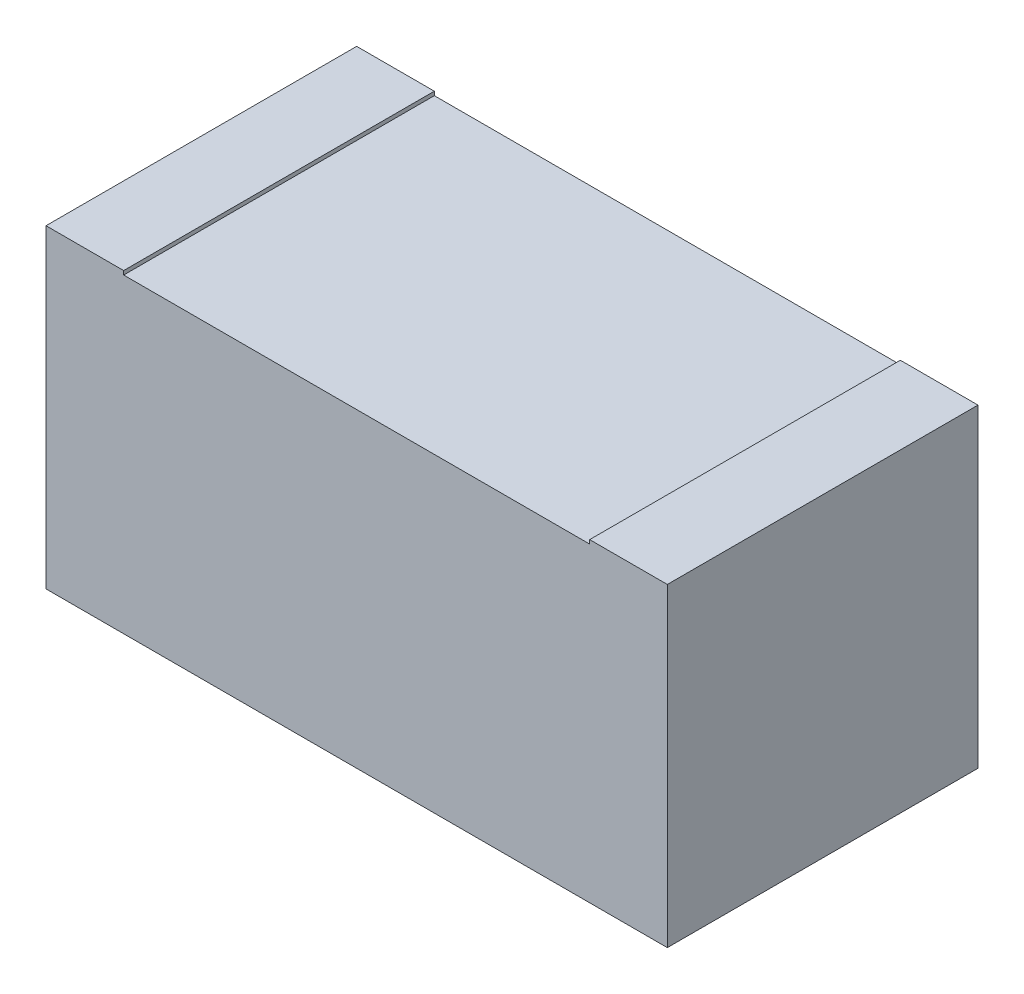
ISO-10303-21;
HEADER;
FILE_DESCRIPTION(('STEP AP214'),'2;1');
FILE_NAME('part.step','',(''),(''),'','','');
FILE_SCHEMA(('AUTOMOTIVE_DESIGN { 1 0 10303 214 1 1 1 1 }'));
ENDSEC;
DATA;
#1=APPLICATION_CONTEXT('core data for automotive mechanical design processes');
#2=APPLICATION_PROTOCOL_DEFINITION('international standard','automotive_design',2000,#1);
#3=PRODUCT_CONTEXT('',#1,'mechanical');
#4=PRODUCT('Part','Part','',(#3));
#5=PRODUCT_RELATED_PRODUCT_CATEGORY('part','',(#4));
#6=PRODUCT_DEFINITION_FORMATION('','',#4);
#7=PRODUCT_DEFINITION_CONTEXT('part definition',#1,'design');
#8=PRODUCT_DEFINITION('design','',#6,#7);
#9=PRODUCT_DEFINITION_SHAPE('','',#8);
#10=(LENGTH_UNIT() NAMED_UNIT(*) SI_UNIT(.MILLI.,.METRE.));
#11=(NAMED_UNIT(*) PLANE_ANGLE_UNIT() SI_UNIT($,.RADIAN.));
#12=(NAMED_UNIT(*) SI_UNIT($,.STERADIAN.) SOLID_ANGLE_UNIT());
#13=UNCERTAINTY_MEASURE_WITH_UNIT(LENGTH_MEASURE(1.E-05),#10,'distance_accuracy_value','');
#14=(GEOMETRIC_REPRESENTATION_CONTEXT(3) GLOBAL_UNCERTAINTY_ASSIGNED_CONTEXT((#13)) GLOBAL_UNIT_ASSIGNED_CONTEXT((#10,
#11,#12)) REPRESENTATION_CONTEXT('',''));
#15=CARTESIAN_POINT('',(0.,0.,0.));
#16=DIRECTION('',(0.,0.,1.));
#17=DIRECTION('',(1.,0.,0.));
#18=AXIS2_PLACEMENT_3D('',#15,#16,#17);
#19=CARTESIAN_POINT('',(0.,0.8,0.));
#20=DIRECTION('',(0.,1.,0.));
#21=DIRECTION('',(0.,0.,1.));
#22=AXIS2_PLACEMENT_3D('',#19,#20,#21);
#23=PLANE('',#22);
#24=DIRECTION('',(1.,0.,0.));
#25=VECTOR('',#24,1.);
#26=CARTESIAN_POINT('',(-0.853781512605042,0.8,0.430252100840336));
#27=LINE('',#26,#25);
#28=CARTESIAN_POINT('',(-0.653781512605042,0.8,0.430252100840336));
#29=VERTEX_POINT('',#28);
#30=CARTESIAN_POINT('',(0.546218487394958,0.8,0.430252100840336));
#31=VERTEX_POINT('',#30);
#32=EDGE_CURVE('E57',#29,#31,#27,.T.);
#33=ORIENTED_EDGE('',*,*,#32,.T.);
#34=DIRECTION('',(0.,0.,1.));
#35=VECTOR('',#34,1.);
#36=CARTESIAN_POINT('',(0.546218487394958,0.8,-0.369747899159664));
#37=LINE('',#36,#35);
#38=CARTESIAN_POINT('',(0.546218487394958,0.8,-0.369747899159664));
#39=VERTEX_POINT('',#38);
#40=EDGE_CURVE('E52',#39,#31,#37,.T.);
#41=ORIENTED_EDGE('',*,*,#40,.F.);
#42=DIRECTION('',(-1.,0.,0.));
#43=VECTOR('',#42,1.);
#44=CARTESIAN_POINT('',(-0.853781512605042,0.8,-0.369747899159664));
#45=LINE('',#44,#43);
#46=CARTESIAN_POINT('',(-0.653781512605042,0.8,-0.369747899159664));
#47=VERTEX_POINT('',#46);
#48=EDGE_CURVE('E155',#39,#47,#45,.T.);
#49=ORIENTED_EDGE('',*,*,#48,.T.);
#50=DIRECTION('',(0.,0.,-1.));
#51=VECTOR('',#50,1.);
#52=CARTESIAN_POINT('',(-0.653781512605042,0.8,-0.369747899159664));
#53=LINE('',#52,#51);
#54=EDGE_CURVE('E134',#29,#47,#53,.T.);
#55=ORIENTED_EDGE('',*,*,#54,.F.);
#56=EDGE_LOOP('',(#33,#41,#49,#55));
#57=FACE_BOUND('',#56,.T.);
#58=ADVANCED_FACE('F37',(#57),#23,.T.);
#59=CARTESIAN_POINT('',(-0.853781512605042,0.8,-0.369747899159664));
#60=DIRECTION('',(1.,0.,0.));
#61=DIRECTION('',(0.,0.,-1.));
#62=AXIS2_PLACEMENT_3D('',#59,#60,#61);
#63=PLANE('',#62);
#64=DIRECTION('',(0.,0.,1.));
#65=VECTOR('',#64,1.);
#66=CARTESIAN_POINT('',(-0.853781512605042,0.,-0.369747899159664));
#67=LINE('',#66,#65);
#68=CARTESIAN_POINT('',(-0.853781512605042,0.,-0.369747899159664));
#69=VERTEX_POINT('',#68);
#70=CARTESIAN_POINT('',(-0.853781512605042,0.,0.430252100840336));
#71=VERTEX_POINT('',#70);
#72=EDGE_CURVE('E153',#69,#71,#67,.T.);
#73=ORIENTED_EDGE('',*,*,#72,.T.);
#74=DIRECTION('',(0.,-1.,0.));
#75=VECTOR('',#74,1.);
#76=CARTESIAN_POINT('',(-0.853781512605042,0.8,0.430252100840336));
#77=LINE('',#76,#75);
#78=CARTESIAN_POINT('',(-0.853781512605042,0.81,0.430252100840336));
#79=VERTEX_POINT('',#78);
#80=EDGE_CURVE('E11',#79,#71,#77,.T.);
#81=ORIENTED_EDGE('',*,*,#80,.F.);
#82=DIRECTION('',(0.,0.,1.));
#83=VECTOR('',#82,1.);
#84=CARTESIAN_POINT('',(-0.853781512605042,0.81,-0.369747899159664));
#85=LINE('',#84,#83);
#86=CARTESIAN_POINT('',(-0.853781512605042,0.81,-0.369747899159664));
#87=VERTEX_POINT('',#86);
#88=EDGE_CURVE('E135',#87,#79,#85,.T.);
#89=ORIENTED_EDGE('',*,*,#88,.F.);
#90=DIRECTION('',(0.,-1.,0.));
#91=VECTOR('',#90,1.);
#92=CARTESIAN_POINT('',(-0.853781512605042,0.8,-0.369747899159664));
#93=LINE('',#92,#91);
#94=EDGE_CURVE('E110',#87,#69,#93,.T.);
#95=ORIENTED_EDGE('',*,*,#94,.T.);
#96=EDGE_LOOP('',(#73,#81,#89,#95));
#97=FACE_BOUND('',#96,.T.);
#98=ADVANCED_FACE('F39',(#97),#63,.F.);
#99=CARTESIAN_POINT('',(-0.853781512605042,0.8,0.430252100840336));
#100=DIRECTION('',(0.,0.,-1.));
#101=DIRECTION('',(-1.,0.,0.));
#102=AXIS2_PLACEMENT_3D('',#99,#100,#101);
#103=PLANE('',#102);
#104=DIRECTION('',(1.,0.,0.));
#105=VECTOR('',#104,1.);
#106=CARTESIAN_POINT('',(-0.853781512605042,0.,0.430252100840336));
#107=LINE('',#106,#105);
#108=CARTESIAN_POINT('',(0.746218487394958,0.,0.430252100840336));
#109=VERTEX_POINT('',#108);
#110=EDGE_CURVE('E160',#71,#109,#107,.T.);
#111=ORIENTED_EDGE('',*,*,#110,.T.);
#112=DIRECTION('',(0.,-1.,0.));
#113=VECTOR('',#112,1.);
#114=CARTESIAN_POINT('',(0.746218487394958,0.8,0.430252100840336));
#115=LINE('',#114,#113);
#116=CARTESIAN_POINT('',(0.746218487394958,0.81,0.430252100840336));
#117=VERTEX_POINT('',#116);
#118=EDGE_CURVE('E45',#117,#109,#115,.T.);
#119=ORIENTED_EDGE('',*,*,#118,.F.);
#120=DIRECTION('',(1.,0.,0.));
#121=VECTOR('',#120,1.);
#122=CARTESIAN_POINT('',(0.746218487394958,0.81,0.430252100840336));
#123=LINE('',#122,#121);
#124=CARTESIAN_POINT('',(0.546218487394958,0.81,0.430252100840336));
#125=VERTEX_POINT('',#124);
#126=EDGE_CURVE('E124',#125,#117,#123,.T.);
#127=ORIENTED_EDGE('',*,*,#126,.F.);
#128=DIRECTION('',(0.,-1.,0.));
#129=VECTOR('',#128,1.);
#130=CARTESIAN_POINT('',(0.546218487394958,0.81,0.430252100840336));
#131=LINE('',#130,#129);
#132=EDGE_CURVE('E129',#125,#31,#131,.T.);
#133=ORIENTED_EDGE('',*,*,#132,.T.);
#134=ORIENTED_EDGE('',*,*,#32,.F.);
#135=DIRECTION('',(0.,-1.,0.));
#136=VECTOR('',#135,1.);
#137=CARTESIAN_POINT('',(-0.653781512605042,0.81,0.430252100840336));
#138=LINE('',#137,#136);
#139=CARTESIAN_POINT('',(-0.653781512605042,0.81,0.430252100840336));
#140=VERTEX_POINT('',#139);
#141=EDGE_CURVE('E150',#140,#29,#138,.T.);
#142=ORIENTED_EDGE('',*,*,#141,.F.);
#143=DIRECTION('',(1.,0.,0.));
#144=VECTOR('',#143,1.);
#145=CARTESIAN_POINT('',(-0.853781512605042,0.81,0.430252100840336));
#146=LINE('',#145,#144);
#147=EDGE_CURVE('E138',#79,#140,#146,.T.);
#148=ORIENTED_EDGE('',*,*,#147,.F.);
#149=ORIENTED_EDGE('',*,*,#80,.T.);
#150=EDGE_LOOP('',(#111,#119,#127,#133,#134,#142,#148,#149));
#151=FACE_BOUND('',#150,.T.);
#152=ADVANCED_FACE('F180',(#151),#103,.F.);
#153=CARTESIAN_POINT('',(0.746218487394958,0.8,-0.369747899159664));
#154=DIRECTION('',(-1.,0.,0.));
#155=DIRECTION('',(0.,0.,1.));
#156=AXIS2_PLACEMENT_3D('',#153,#154,#155);
#157=PLANE('',#156);
#158=DIRECTION('',(0.,0.,-1.));
#159=VECTOR('',#158,1.);
#160=CARTESIAN_POINT('',(0.746218487394958,0.,-0.369747899159664));
#161=LINE('',#160,#159);
#162=CARTESIAN_POINT('',(0.746218487394958,0.,-0.369747899159664));
#163=VERTEX_POINT('',#162);
#164=EDGE_CURVE('E107',#109,#163,#161,.T.);
#165=ORIENTED_EDGE('',*,*,#164,.T.);
#166=DIRECTION('',(0.,-1.,0.));
#167=VECTOR('',#166,1.);
#168=CARTESIAN_POINT('',(0.746218487394958,0.8,-0.369747899159664));
#169=LINE('',#168,#167);
#170=CARTESIAN_POINT('',(0.746218487394958,0.81,-0.369747899159664));
#171=VERTEX_POINT('',#170);
#172=EDGE_CURVE('E100',#171,#163,#169,.T.);
#173=ORIENTED_EDGE('',*,*,#172,.F.);
#174=DIRECTION('',(0.,0.,-1.));
#175=VECTOR('',#174,1.);
#176=CARTESIAN_POINT('',(0.746218487394958,0.81,-0.369747899159664));
#177=LINE('',#176,#175);
#178=EDGE_CURVE('E105',#117,#171,#177,.T.);
#179=ORIENTED_EDGE('',*,*,#178,.F.);
#180=ORIENTED_EDGE('',*,*,#118,.T.);
#181=EDGE_LOOP('',(#165,#173,#179,#180));
#182=FACE_BOUND('',#181,.T.);
#183=ADVANCED_FACE('F102',(#182),#157,.F.);
#184=CARTESIAN_POINT('',(-0.853781512605042,0.8,-0.369747899159664));
#185=DIRECTION('',(0.,0.,1.));
#186=DIRECTION('',(1.,0.,0.));
#187=AXIS2_PLACEMENT_3D('',#184,#185,#186);
#188=PLANE('',#187);
#189=DIRECTION('',(-1.,0.,0.));
#190=VECTOR('',#189,1.);
#191=CARTESIAN_POINT('',(-0.853781512605042,0.,-0.369747899159664));
#192=LINE('',#191,#190);
#193=EDGE_CURVE('E156',#163,#69,#192,.T.);
#194=ORIENTED_EDGE('',*,*,#193,.T.);
#195=ORIENTED_EDGE('',*,*,#94,.F.);
#196=DIRECTION('',(-1.,0.,0.));
#197=VECTOR('',#196,1.);
#198=CARTESIAN_POINT('',(-0.853781512605042,0.81,-0.369747899159664));
#199=LINE('',#198,#197);
#200=CARTESIAN_POINT('',(-0.653781512605042,0.81,-0.369747899159664));
#201=VERTEX_POINT('',#200);
#202=EDGE_CURVE('E142',#201,#87,#199,.T.);
#203=ORIENTED_EDGE('',*,*,#202,.F.);
#204=DIRECTION('',(0.,-1.,0.));
#205=VECTOR('',#204,1.);
#206=CARTESIAN_POINT('',(-0.653781512605042,0.81,-0.369747899159664));
#207=LINE('',#206,#205);
#208=EDGE_CURVE('E145',#201,#47,#207,.T.);
#209=ORIENTED_EDGE('',*,*,#208,.T.);
#210=ORIENTED_EDGE('',*,*,#48,.F.);
#211=DIRECTION('',(0.,-1.,0.));
#212=VECTOR('',#211,1.);
#213=CARTESIAN_POINT('',(0.546218487394958,0.81,-0.369747899159664));
#214=LINE('',#213,#212);
#215=CARTESIAN_POINT('',(0.546218487394958,0.81,-0.369747899159664));
#216=VERTEX_POINT('',#215);
#217=EDGE_CURVE('E116',#216,#39,#214,.T.);
#218=ORIENTED_EDGE('',*,*,#217,.F.);
#219=DIRECTION('',(-1.,0.,0.));
#220=VECTOR('',#219,1.);
#221=CARTESIAN_POINT('',(0.746218487394958,0.81,-0.369747899159664));
#222=LINE('',#221,#220);
#223=EDGE_CURVE('E113',#171,#216,#222,.T.);
#224=ORIENTED_EDGE('',*,*,#223,.F.);
#225=ORIENTED_EDGE('',*,*,#172,.T.);
#226=EDGE_LOOP('',(#194,#195,#203,#209,#210,#218,#224,#225));
#227=FACE_BOUND('',#226,.T.);
#228=ADVANCED_FACE('F114',(#227),#188,.F.);
#229=CARTESIAN_POINT('',(0.,0.,0.));
#230=DIRECTION('',(0.,1.,0.));
#231=DIRECTION('',(0.,0.,1.));
#232=AXIS2_PLACEMENT_3D('',#229,#230,#231);
#233=PLANE('',#232);
#234=ORIENTED_EDGE('',*,*,#72,.F.);
#235=ORIENTED_EDGE('',*,*,#193,.F.);
#236=ORIENTED_EDGE('',*,*,#164,.F.);
#237=ORIENTED_EDGE('',*,*,#110,.F.);
#238=EDGE_LOOP('',(#234,#235,#236,#237));
#239=FACE_BOUND('',#238,.T.);
#240=ADVANCED_FACE('F168',(#239),#233,.F.);
#241=CARTESIAN_POINT('',(-0.653781512605042,0.81,-0.369747899159664));
#242=DIRECTION('',(-1.,0.,0.));
#243=DIRECTION('',(0.,0.,1.));
#244=AXIS2_PLACEMENT_3D('',#241,#242,#243);
#245=PLANE('',#244);
#246=ORIENTED_EDGE('',*,*,#54,.T.);
#247=ORIENTED_EDGE('',*,*,#208,.F.);
#248=DIRECTION('',(0.,0.,-1.));
#249=VECTOR('',#248,1.);
#250=CARTESIAN_POINT('',(-0.653781512605042,0.81,-0.369747899159664));
#251=LINE('',#250,#249);
#252=EDGE_CURVE('E140',#140,#201,#251,.T.);
#253=ORIENTED_EDGE('',*,*,#252,.F.);
#254=ORIENTED_EDGE('',*,*,#141,.T.);
#255=EDGE_LOOP('',(#246,#247,#253,#254));
#256=FACE_BOUND('',#255,.T.);
#257=ADVANCED_FACE('F179',(#256),#245,.F.);
#258=CARTESIAN_POINT('',(0.,0.81,0.));
#259=DIRECTION('',(0.,1.,0.));
#260=DIRECTION('',(0.,0.,1.));
#261=AXIS2_PLACEMENT_3D('',#258,#259,#260);
#262=PLANE('',#261);
#263=ORIENTED_EDGE('',*,*,#88,.T.);
#264=ORIENTED_EDGE('',*,*,#147,.T.);
#265=ORIENTED_EDGE('',*,*,#252,.T.);
#266=ORIENTED_EDGE('',*,*,#202,.T.);
#267=EDGE_LOOP('',(#263,#264,#265,#266));
#268=FACE_BOUND('',#267,.T.);
#269=ADVANCED_FACE('F174',(#268),#262,.T.);
#270=CARTESIAN_POINT('',(0.546218487394958,0.81,-0.369747899159664));
#271=DIRECTION('',(1.,0.,0.));
#272=DIRECTION('',(0.,0.,-1.));
#273=AXIS2_PLACEMENT_3D('',#270,#271,#272);
#274=PLANE('',#273);
#275=ORIENTED_EDGE('',*,*,#40,.T.);
#276=ORIENTED_EDGE('',*,*,#132,.F.);
#277=DIRECTION('',(0.,0.,1.));
#278=VECTOR('',#277,1.);
#279=CARTESIAN_POINT('',(0.546218487394958,0.81,-0.369747899159664));
#280=LINE('',#279,#278);
#281=EDGE_CURVE('E119',#216,#125,#280,.T.);
#282=ORIENTED_EDGE('',*,*,#281,.F.);
#283=ORIENTED_EDGE('',*,*,#217,.T.);
#284=EDGE_LOOP('',(#275,#276,#282,#283));
#285=FACE_BOUND('',#284,.T.);
#286=ADVANCED_FACE('F183',(#285),#274,.F.);
#287=CARTESIAN_POINT('',(0.,0.81,0.));
#288=DIRECTION('',(0.,-1.,0.));
#289=DIRECTION('',(0.,0.,-1.));
#290=AXIS2_PLACEMENT_3D('',#287,#288,#289);
#291=PLANE('',#290);
#292=ORIENTED_EDGE('',*,*,#178,.T.);
#293=ORIENTED_EDGE('',*,*,#223,.T.);
#294=ORIENTED_EDGE('',*,*,#281,.T.);
#295=ORIENTED_EDGE('',*,*,#126,.T.);
#296=EDGE_LOOP('',(#292,#293,#294,#295));
#297=FACE_BOUND('',#296,.T.);
#298=ADVANCED_FACE('F122',(#297),#291,.F.);
#299=CLOSED_SHELL('',(#58,#98,#152,#183,#228,#240,#257,#269,#286,#298));
#300=MANIFOLD_SOLID_BREP('B2',#299);
#301=ADVANCED_BREP_SHAPE_REPRESENTATION('',(#18,#300),#14);
#302=SHAPE_DEFINITION_REPRESENTATION(#9,#301);
ENDSEC;
END-ISO-10303-21;
